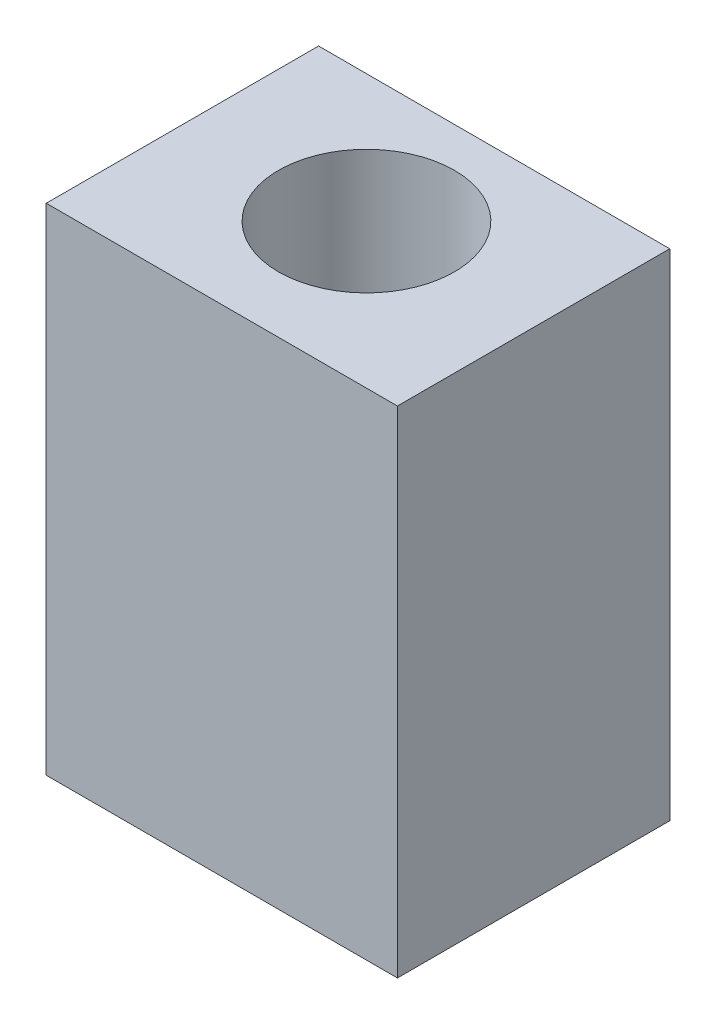
ISO-10303-21;
HEADER;
FILE_DESCRIPTION(('STEP AP214'),'2;1');
FILE_NAME('part.step','',(''),(''),'','','');
FILE_SCHEMA(('AUTOMOTIVE_DESIGN { 1 0 10303 214 1 1 1 1 }'));
ENDSEC;
DATA;
#1=APPLICATION_CONTEXT('core data for automotive mechanical design processes');
#2=APPLICATION_PROTOCOL_DEFINITION('international standard','automotive_design',2000,#1);
#3=PRODUCT_CONTEXT('',#1,'mechanical');
#4=PRODUCT('Part','Part','',(#3));
#5=PRODUCT_RELATED_PRODUCT_CATEGORY('part','',(#4));
#6=PRODUCT_DEFINITION_FORMATION('','',#4);
#7=PRODUCT_DEFINITION_CONTEXT('part definition',#1,'design');
#8=PRODUCT_DEFINITION('design','',#6,#7);
#9=PRODUCT_DEFINITION_SHAPE('','',#8);
#10=(LENGTH_UNIT() NAMED_UNIT(*) SI_UNIT(.MILLI.,.METRE.));
#11=(NAMED_UNIT(*) PLANE_ANGLE_UNIT() SI_UNIT($,.RADIAN.));
#12=(NAMED_UNIT(*) SI_UNIT($,.STERADIAN.) SOLID_ANGLE_UNIT());
#13=UNCERTAINTY_MEASURE_WITH_UNIT(LENGTH_MEASURE(1.E-05),#10,'distance_accuracy_value','');
#14=(GEOMETRIC_REPRESENTATION_CONTEXT(3) GLOBAL_UNCERTAINTY_ASSIGNED_CONTEXT((#13)) GLOBAL_UNIT_ASSIGNED_CONTEXT((#10,
#11,#12)) REPRESENTATION_CONTEXT('',''));
#15=CARTESIAN_POINT('',(0.,0.,0.));
#16=DIRECTION('',(0.,0.,1.));
#17=DIRECTION('',(1.,0.,0.));
#18=AXIS2_PLACEMENT_3D('',#15,#16,#17);
#19=CARTESIAN_POINT('',(20.955,59.1185,16.25));
#20=DIRECTION('',(-1.,0.,0.));
#21=DIRECTION('',(0.,0.,1.));
#22=AXIS2_PLACEMENT_3D('',#19,#20,#21);
#23=PLANE('',#22);
#24=DIRECTION('',(0.,0.,-1.));
#25=VECTOR('',#24,1.);
#26=CARTESIAN_POINT('',(20.955,0.,16.25));
#27=LINE('',#26,#25);
#28=CARTESIAN_POINT('',(20.955,0.,16.25));
#29=VERTEX_POINT('',#28);
#30=CARTESIAN_POINT('',(20.955,0.,-16.25));
#31=VERTEX_POINT('',#30);
#32=EDGE_CURVE('E133',#29,#31,#27,.T.);
#33=ORIENTED_EDGE('',*,*,#32,.T.);
#34=DIRECTION('',(0.,-1.,0.));
#35=VECTOR('',#34,1.);
#36=CARTESIAN_POINT('',(20.955,59.1185,-16.25));
#37=LINE('',#36,#35);
#38=CARTESIAN_POINT('',(20.955,59.1185,-16.25));
#39=VERTEX_POINT('',#38);
#40=EDGE_CURVE('E11',#39,#31,#37,.T.);
#41=ORIENTED_EDGE('',*,*,#40,.F.);
#42=DIRECTION('',(0.,0.,-1.));
#43=VECTOR('',#42,1.);
#44=CARTESIAN_POINT('',(20.955,59.1185,16.25));
#45=LINE('',#44,#43);
#46=CARTESIAN_POINT('',(20.955,59.1185,16.25));
#47=VERTEX_POINT('',#46);
#48=EDGE_CURVE('E136',#47,#39,#45,.T.);
#49=ORIENTED_EDGE('',*,*,#48,.F.);
#50=DIRECTION('',(0.,-1.,0.));
#51=VECTOR('',#50,1.);
#52=CARTESIAN_POINT('',(20.955,59.1185,16.25));
#53=LINE('',#52,#51);
#54=EDGE_CURVE('E142',#47,#29,#53,.T.);
#55=ORIENTED_EDGE('',*,*,#54,.T.);
#56=EDGE_LOOP('',(#33,#41,#49,#55));
#57=FACE_BOUND('',#56,.T.);
#58=ADVANCED_FACE('F36',(#57),#23,.F.);
#59=CARTESIAN_POINT('',(-20.955,59.1185,-16.25));
#60=DIRECTION('',(0.,0.,1.));
#61=DIRECTION('',(1.,0.,0.));
#62=AXIS2_PLACEMENT_3D('',#59,#60,#61);
#63=PLANE('',#62);
#64=CARTESIAN_POINT('',(14.986,14.31925,-16.25));
#65=DIRECTION('',(0.,0.,-1.));
#66=DIRECTION('',(-1.,0.,0.));
#67=AXIS2_PLACEMENT_3D('',#64,#65,#66);
#68=CIRCLE('',#67,2.01929999999999);
#69=CARTESIAN_POINT('',(12.9667,14.31925,-16.25));
#70=VERTEX_POINT('',#69);
#71=EDGE_CURVE('E107',#70,#70,#68,.T.);
#72=ORIENTED_EDGE('',*,*,#71,.F.);
#73=EDGE_LOOP('',(#72));
#74=FACE_BOUND('',#73,.T.);
#75=CARTESIAN_POINT('',(-14.986,14.31925,-16.25));
#76=DIRECTION('',(0.,0.,-1.));
#77=DIRECTION('',(-1.,0.,0.));
#78=AXIS2_PLACEMENT_3D('',#75,#76,#77);
#79=CIRCLE('',#78,2.01929999999999);
#80=CARTESIAN_POINT('',(-17.0053,14.31925,-16.25));
#81=VERTEX_POINT('',#80);
#82=EDGE_CURVE('E106',#81,#81,#79,.T.);
#83=ORIENTED_EDGE('',*,*,#82,.F.);
#84=EDGE_LOOP('',(#83));
#85=FACE_BOUND('',#84,.T.);
#86=CARTESIAN_POINT('',(-14.986,44.79925,-16.25));
#87=DIRECTION('',(0.,0.,-1.));
#88=DIRECTION('',(-1.,0.,0.));
#89=AXIS2_PLACEMENT_3D('',#86,#87,#88);
#90=CIRCLE('',#89,2.01929999999999);
#91=CARTESIAN_POINT('',(-17.0053,44.79925,-16.25));
#92=VERTEX_POINT('',#91);
#93=EDGE_CURVE('E117',#92,#92,#90,.T.);
#94=ORIENTED_EDGE('',*,*,#93,.F.);
#95=EDGE_LOOP('',(#94));
#96=FACE_BOUND('',#95,.T.);
#97=CARTESIAN_POINT('',(14.986,44.79925,-16.25));
#98=DIRECTION('',(0.,0.,-1.));
#99=DIRECTION('',(-1.,0.,0.));
#100=AXIS2_PLACEMENT_3D('',#97,#98,#99);
#101=CIRCLE('',#100,2.01929999999999);
#102=CARTESIAN_POINT('',(12.9667,44.79925,-16.25));
#103=VERTEX_POINT('',#102);
#104=EDGE_CURVE('E123',#103,#103,#101,.T.);
#105=ORIENTED_EDGE('',*,*,#104,.F.);
#106=EDGE_LOOP('',(#105));
#107=FACE_BOUND('',#106,.T.);
#108=DIRECTION('',(-1.,0.,0.));
#109=VECTOR('',#108,1.);
#110=CARTESIAN_POINT('',(-20.955,0.,-16.25));
#111=LINE('',#110,#109);
#112=CARTESIAN_POINT('',(-20.955,0.,-16.25));
#113=VERTEX_POINT('',#112);
#114=EDGE_CURVE('E145',#31,#113,#111,.T.);
#115=ORIENTED_EDGE('',*,*,#114,.T.);
#116=DIRECTION('',(0.,-1.,0.));
#117=VECTOR('',#116,1.);
#118=CARTESIAN_POINT('',(-20.955,59.1185,-16.25));
#119=LINE('',#118,#117);
#120=CARTESIAN_POINT('',(-20.955,59.1185,-16.25));
#121=VERTEX_POINT('',#120);
#122=EDGE_CURVE('E44',#121,#113,#119,.T.);
#123=ORIENTED_EDGE('',*,*,#122,.F.);
#124=DIRECTION('',(-1.,0.,0.));
#125=VECTOR('',#124,1.);
#126=CARTESIAN_POINT('',(-20.955,59.1185,-16.25));
#127=LINE('',#126,#125);
#128=EDGE_CURVE('E83',#39,#121,#127,.T.);
#129=ORIENTED_EDGE('',*,*,#128,.F.);
#130=ORIENTED_EDGE('',*,*,#40,.T.);
#131=EDGE_LOOP('',(#115,#123,#129,#130));
#132=FACE_BOUND('',#131,.T.);
#133=ADVANCED_FACE('F169',(#74,#85,#96,#107,#132),#63,.F.);
#134=CARTESIAN_POINT('',(-20.955,59.1185,16.25));
#135=DIRECTION('',(1.,0.,0.));
#136=DIRECTION('',(0.,0.,-1.));
#137=AXIS2_PLACEMENT_3D('',#134,#135,#136);
#138=PLANE('',#137);
#139=DIRECTION('',(0.,0.,1.));
#140=VECTOR('',#139,1.);
#141=CARTESIAN_POINT('',(-20.955,0.,16.25));
#142=LINE('',#141,#140);
#143=CARTESIAN_POINT('',(-20.955,0.,16.25));
#144=VERTEX_POINT('',#143);
#145=EDGE_CURVE('E70',#113,#144,#142,.T.);
#146=ORIENTED_EDGE('',*,*,#145,.T.);
#147=DIRECTION('',(0.,-1.,0.));
#148=VECTOR('',#147,1.);
#149=CARTESIAN_POINT('',(-20.955,59.1185,16.25));
#150=LINE('',#149,#148);
#151=CARTESIAN_POINT('',(-20.955,59.1185,16.25));
#152=VERTEX_POINT('',#151);
#153=EDGE_CURVE('E150',#152,#144,#150,.T.);
#154=ORIENTED_EDGE('',*,*,#153,.F.);
#155=DIRECTION('',(0.,0.,1.));
#156=VECTOR('',#155,1.);
#157=CARTESIAN_POINT('',(-20.955,59.1185,16.25));
#158=LINE('',#157,#156);
#159=EDGE_CURVE('E139',#121,#152,#158,.T.);
#160=ORIENTED_EDGE('',*,*,#159,.F.);
#161=ORIENTED_EDGE('',*,*,#122,.T.);
#162=EDGE_LOOP('',(#146,#154,#160,#161));
#163=FACE_BOUND('',#162,.T.);
#164=ADVANCED_FACE('F152',(#163),#138,.F.);
#165=CARTESIAN_POINT('',(-20.955,59.1185,16.25));
#166=DIRECTION('',(0.,0.,-1.));
#167=DIRECTION('',(-1.,0.,0.));
#168=AXIS2_PLACEMENT_3D('',#165,#166,#167);
#169=PLANE('',#168);
#170=DIRECTION('',(1.,0.,0.));
#171=VECTOR('',#170,1.);
#172=CARTESIAN_POINT('',(-20.955,0.,16.25));
#173=LINE('',#172,#171);
#174=EDGE_CURVE('E76',#144,#29,#173,.T.);
#175=ORIENTED_EDGE('',*,*,#174,.T.);
#176=ORIENTED_EDGE('',*,*,#54,.F.);
#177=DIRECTION('',(1.,0.,0.));
#178=VECTOR('',#177,1.);
#179=CARTESIAN_POINT('',(-20.955,59.1185,16.25));
#180=LINE('',#179,#178);
#181=EDGE_CURVE('E52',#152,#47,#180,.T.);
#182=ORIENTED_EDGE('',*,*,#181,.F.);
#183=ORIENTED_EDGE('',*,*,#153,.T.);
#184=EDGE_LOOP('',(#175,#176,#182,#183));
#185=FACE_BOUND('',#184,.T.);
#186=ADVANCED_FACE('F159',(#185),#169,.F.);
#187=CARTESIAN_POINT('',(0.,59.1185,0.));
#188=DIRECTION('',(0.,-1.,0.));
#189=DIRECTION('',(0.,0.,-1.));
#190=AXIS2_PLACEMENT_3D('',#187,#188,#189);
#191=PLANE('',#190);
#192=CARTESIAN_POINT('',(0.,59.1185,-1.01));
#193=DIRECTION('',(0.,1.,0.));
#194=DIRECTION('',(0.,0.,1.));
#195=AXIS2_PLACEMENT_3D('',#192,#193,#194);
#196=CIRCLE('',#195,10.5);
#197=CARTESIAN_POINT('',(0.,59.1185,9.49));
#198=VERTEX_POINT('',#197);
#199=EDGE_CURVE('E129',#198,#198,#196,.T.);
#200=ORIENTED_EDGE('',*,*,#199,.F.);
#201=EDGE_LOOP('',(#200));
#202=FACE_BOUND('',#201,.T.);
#203=ORIENTED_EDGE('',*,*,#48,.T.);
#204=ORIENTED_EDGE('',*,*,#128,.T.);
#205=ORIENTED_EDGE('',*,*,#159,.T.);
#206=ORIENTED_EDGE('',*,*,#181,.T.);
#207=EDGE_LOOP('',(#203,#204,#205,#206));
#208=FACE_BOUND('',#207,.T.);
#209=ADVANCED_FACE('F161',(#202,#208),#191,.F.);
#210=CARTESIAN_POINT('',(0.,0.,0.));
#211=DIRECTION('',(0.,-1.,0.));
#212=DIRECTION('',(0.,0.,-1.));
#213=AXIS2_PLACEMENT_3D('',#210,#211,#212);
#214=PLANE('',#213);
#215=CARTESIAN_POINT('',(0.,0.,-1.01));
#216=DIRECTION('',(0.,1.,0.));
#217=DIRECTION('',(0.,0.,1.));
#218=AXIS2_PLACEMENT_3D('',#215,#216,#217);
#219=CIRCLE('',#218,10.5);
#220=CARTESIAN_POINT('',(0.,0.,9.49));
#221=VERTEX_POINT('',#220);
#222=EDGE_CURVE('E130',#221,#221,#219,.T.);
#223=ORIENTED_EDGE('',*,*,#222,.T.);
#224=EDGE_LOOP('',(#223));
#225=FACE_BOUND('',#224,.T.);
#226=ORIENTED_EDGE('',*,*,#32,.F.);
#227=ORIENTED_EDGE('',*,*,#174,.F.);
#228=ORIENTED_EDGE('',*,*,#145,.F.);
#229=ORIENTED_EDGE('',*,*,#114,.F.);
#230=EDGE_LOOP('',(#226,#227,#228,#229));
#231=FACE_BOUND('',#230,.T.);
#232=ADVANCED_FACE('F155',(#225,#231),#214,.T.);
#233=CARTESIAN_POINT('',(0.,0.,-1.01));
#234=DIRECTION('',(0.,1.,0.));
#235=DIRECTION('',(0.,0.,1.));
#236=AXIS2_PLACEMENT_3D('',#233,#234,#235);
#237=CYLINDRICAL_SURFACE('',#236,10.5);
#238=ORIENTED_EDGE('',*,*,#222,.F.);
#239=EDGE_LOOP('',(#238));
#240=FACE_BOUND('',#239,.T.);
#241=ORIENTED_EDGE('',*,*,#199,.T.);
#242=EDGE_LOOP('',(#241));
#243=FACE_BOUND('',#242,.T.);
#244=ADVANCED_FACE('F202',(#240,#243),#237,.F.);
#245=CARTESIAN_POINT('',(14.986,44.79925,-6.344));
#246=DIRECTION('',(0.,0.,-1.));
#247=DIRECTION('',(-1.,0.,0.));
#248=AXIS2_PLACEMENT_3D('',#245,#246,#247);
#249=CONICAL_SURFACE('',#248,2.0193,1.02974425867665);
#250=CARTESIAN_POINT('',(14.986,44.79925,-5.13068215199765));
#251=VERTEX_POINT('',#250);
#252=VERTEX_LOOP('',#251);
#253=FACE_BOUND('',#252,.T.);
#254=CARTESIAN_POINT('',(14.986,44.79925,-6.344));
#255=DIRECTION('',(0.,0.,-1.));
#256=DIRECTION('',(-1.,0.,0.));
#257=AXIS2_PLACEMENT_3D('',#254,#255,#256);
#258=CIRCLE('',#257,2.0193);
#259=CARTESIAN_POINT('',(12.9667,44.79925,-6.344));
#260=VERTEX_POINT('',#259);
#261=EDGE_CURVE('E126',#260,#260,#258,.T.);
#262=ORIENTED_EDGE('',*,*,#261,.T.);
#263=EDGE_LOOP('',(#262));
#264=FACE_BOUND('',#263,.T.);
#265=ADVANCED_FACE('F192',(#253,#264),#249,.F.);
#266=CARTESIAN_POINT('',(14.986,44.79925,-16.25));
#267=DIRECTION('',(0.,0.,-1.));
#268=DIRECTION('',(-1.,0.,0.));
#269=AXIS2_PLACEMENT_3D('',#266,#267,#268);
#270=CYLINDRICAL_SURFACE('',#269,2.01929999999999);
#271=ORIENTED_EDGE('',*,*,#261,.F.);
#272=EDGE_LOOP('',(#271));
#273=FACE_BOUND('',#272,.T.);
#274=ORIENTED_EDGE('',*,*,#104,.T.);
#275=EDGE_LOOP('',(#274));
#276=FACE_BOUND('',#275,.T.);
#277=ADVANCED_FACE('F189',(#273,#276),#270,.F.);
#278=CARTESIAN_POINT('',(-14.986,44.79925,-6.344));
#279=DIRECTION('',(0.,0.,-1.));
#280=DIRECTION('',(-1.,0.,0.));
#281=AXIS2_PLACEMENT_3D('',#278,#279,#280);
#282=CONICAL_SURFACE('',#281,2.0193,1.02974425867665);
#283=CARTESIAN_POINT('',(-14.986,44.79925,-5.13068215199765));
#284=VERTEX_POINT('',#283);
#285=VERTEX_LOOP('',#284);
#286=FACE_BOUND('',#285,.T.);
#287=CARTESIAN_POINT('',(-14.986,44.79925,-6.344));
#288=DIRECTION('',(0.,0.,-1.));
#289=DIRECTION('',(-1.,0.,0.));
#290=AXIS2_PLACEMENT_3D('',#287,#288,#289);
#291=CIRCLE('',#290,2.0193);
#292=CARTESIAN_POINT('',(-17.0053,44.79925,-6.344));
#293=VERTEX_POINT('',#292);
#294=EDGE_CURVE('E120',#293,#293,#291,.T.);
#295=ORIENTED_EDGE('',*,*,#294,.T.);
#296=EDGE_LOOP('',(#295));
#297=FACE_BOUND('',#296,.T.);
#298=ADVANCED_FACE('F191',(#286,#297),#282,.F.);
#299=CARTESIAN_POINT('',(-14.986,44.79925,-16.25));
#300=DIRECTION('',(0.,0.,-1.));
#301=DIRECTION('',(-1.,0.,0.));
#302=AXIS2_PLACEMENT_3D('',#299,#300,#301);
#303=CYLINDRICAL_SURFACE('',#302,2.01929999999999);
#304=ORIENTED_EDGE('',*,*,#294,.F.);
#305=EDGE_LOOP('',(#304));
#306=FACE_BOUND('',#305,.T.);
#307=ORIENTED_EDGE('',*,*,#93,.T.);
#308=EDGE_LOOP('',(#307));
#309=FACE_BOUND('',#308,.T.);
#310=ADVANCED_FACE('F199',(#306,#309),#303,.F.);
#311=CARTESIAN_POINT('',(-14.986,14.31925,-6.344));
#312=DIRECTION('',(0.,0.,-1.));
#313=DIRECTION('',(-1.,0.,0.));
#314=AXIS2_PLACEMENT_3D('',#311,#312,#313);
#315=CONICAL_SURFACE('',#314,2.0193,1.02974425867665);
#316=CARTESIAN_POINT('',(-14.986,14.31925,-5.13068215199765));
#317=VERTEX_POINT('',#316);
#318=VERTEX_LOOP('',#317);
#319=FACE_BOUND('',#318,.T.);
#320=CARTESIAN_POINT('',(-14.986,14.31925,-6.344));
#321=DIRECTION('',(0.,0.,-1.));
#322=DIRECTION('',(-1.,0.,0.));
#323=AXIS2_PLACEMENT_3D('',#320,#321,#322);
#324=CIRCLE('',#323,2.0193);
#325=CARTESIAN_POINT('',(-17.0053,14.31925,-6.344));
#326=VERTEX_POINT('',#325);
#327=EDGE_CURVE('E110',#326,#326,#324,.T.);
#328=ORIENTED_EDGE('',*,*,#327,.T.);
#329=EDGE_LOOP('',(#328));
#330=FACE_BOUND('',#329,.T.);
#331=ADVANCED_FACE('F248',(#319,#330),#315,.F.);
#332=CARTESIAN_POINT('',(-14.986,14.31925,-16.25));
#333=DIRECTION('',(0.,0.,-1.));
#334=DIRECTION('',(-1.,0.,0.));
#335=AXIS2_PLACEMENT_3D('',#332,#333,#334);
#336=CYLINDRICAL_SURFACE('',#335,2.01929999999999);
#337=ORIENTED_EDGE('',*,*,#327,.F.);
#338=EDGE_LOOP('',(#337));
#339=FACE_BOUND('',#338,.T.);
#340=ORIENTED_EDGE('',*,*,#82,.T.);
#341=EDGE_LOOP('',(#340));
#342=FACE_BOUND('',#341,.T.);
#343=ADVANCED_FACE('F100',(#339,#342),#336,.F.);
#344=CARTESIAN_POINT('',(14.986,14.31925,-6.344));
#345=DIRECTION('',(0.,0.,-1.));
#346=DIRECTION('',(-1.,0.,0.));
#347=AXIS2_PLACEMENT_3D('',#344,#345,#346);
#348=CONICAL_SURFACE('',#347,2.0193,1.02974425867665);
#349=CARTESIAN_POINT('',(14.986,14.31925,-5.13068215199765));
#350=VERTEX_POINT('',#349);
#351=VERTEX_LOOP('',#350);
#352=FACE_BOUND('',#351,.T.);
#353=CARTESIAN_POINT('',(14.986,14.31925,-6.344));
#354=DIRECTION('',(0.,0.,-1.));
#355=DIRECTION('',(-1.,0.,0.));
#356=AXIS2_PLACEMENT_3D('',#353,#354,#355);
#357=CIRCLE('',#356,2.0193);
#358=CARTESIAN_POINT('',(12.9667,14.31925,-6.344));
#359=VERTEX_POINT('',#358);
#360=EDGE_CURVE('E104',#359,#359,#357,.T.);
#361=ORIENTED_EDGE('',*,*,#360,.T.);
#362=EDGE_LOOP('',(#361));
#363=FACE_BOUND('',#362,.T.);
#364=ADVANCED_FACE('F96',(#352,#363),#348,.F.);
#365=CARTESIAN_POINT('',(14.986,14.31925,-16.25));
#366=DIRECTION('',(0.,0.,-1.));
#367=DIRECTION('',(-1.,0.,0.));
#368=AXIS2_PLACEMENT_3D('',#365,#366,#367);
#369=CYLINDRICAL_SURFACE('',#368,2.01929999999999);
#370=ORIENTED_EDGE('',*,*,#360,.F.);
#371=EDGE_LOOP('',(#370));
#372=FACE_BOUND('',#371,.T.);
#373=ORIENTED_EDGE('',*,*,#71,.T.);
#374=EDGE_LOOP('',(#373));
#375=FACE_BOUND('',#374,.T.);
#376=ADVANCED_FACE('F99',(#372,#375),#369,.F.);
#377=CLOSED_SHELL('',(#58,#133,#164,#186,#209,#232,#244,#265,#277,#298,#310,#331,#343,#364,#376));
#378=MANIFOLD_SOLID_BREP('B2',#377);
#379=ADVANCED_BREP_SHAPE_REPRESENTATION('',(#18,#378),#14);
#380=SHAPE_DEFINITION_REPRESENTATION(#9,#379);
ENDSEC;
END-ISO-10303-21;
